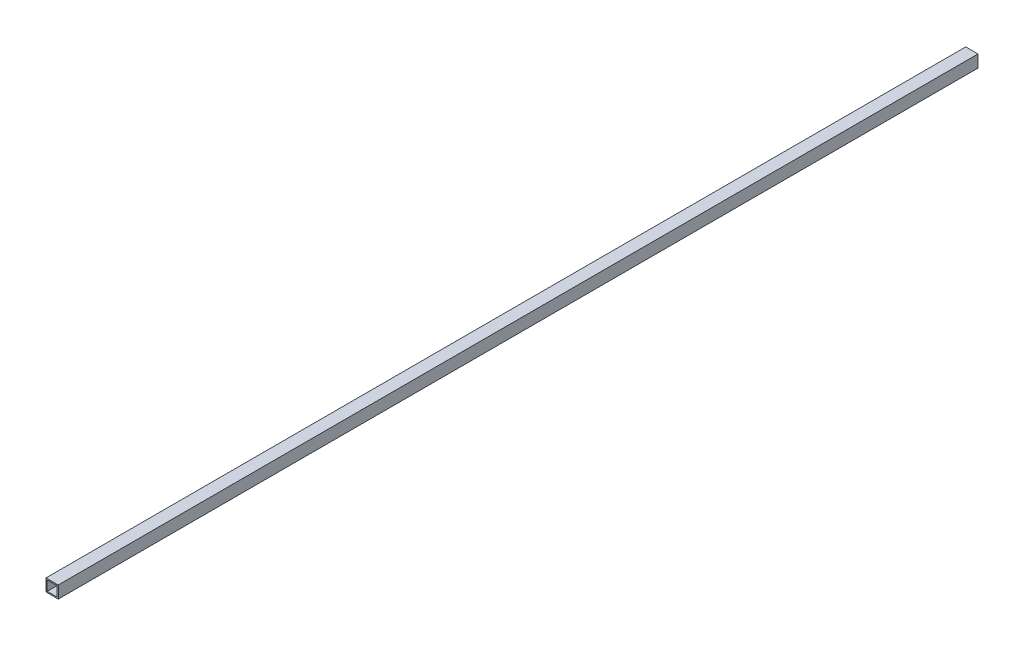
ISO-10303-21;
HEADER;
FILE_DESCRIPTION(('STEP AP214'),'2;1');
FILE_NAME('part.step','',(''),(''),'','','');
FILE_SCHEMA(('AUTOMOTIVE_DESIGN { 1 0 10303 214 1 1 1 1 }'));
ENDSEC;
DATA;
#1=APPLICATION_CONTEXT('core data for automotive mechanical design processes');
#2=APPLICATION_PROTOCOL_DEFINITION('international standard','automotive_design',2000,#1);
#3=PRODUCT_CONTEXT('',#1,'mechanical');
#4=PRODUCT('Part','Part','',(#3));
#5=PRODUCT_RELATED_PRODUCT_CATEGORY('part','',(#4));
#6=PRODUCT_DEFINITION_FORMATION('','',#4);
#7=PRODUCT_DEFINITION_CONTEXT('part definition',#1,'design');
#8=PRODUCT_DEFINITION('design','',#6,#7);
#9=PRODUCT_DEFINITION_SHAPE('','',#8);
#10=(LENGTH_UNIT() NAMED_UNIT(*) SI_UNIT(.MILLI.,.METRE.));
#11=(NAMED_UNIT(*) PLANE_ANGLE_UNIT() SI_UNIT($,.RADIAN.));
#12=(NAMED_UNIT(*) SI_UNIT($,.STERADIAN.) SOLID_ANGLE_UNIT());
#13=UNCERTAINTY_MEASURE_WITH_UNIT(LENGTH_MEASURE(1.E-05),#10,'distance_accuracy_value','');
#14=(GEOMETRIC_REPRESENTATION_CONTEXT(3) GLOBAL_UNCERTAINTY_ASSIGNED_CONTEXT((#13)) GLOBAL_UNIT_ASSIGNED_CONTEXT((#10,
#11,#12)) REPRESENTATION_CONTEXT('',''));
#15=CARTESIAN_POINT('',(0.,0.,0.));
#16=DIRECTION('',(0.,0.,1.));
#17=DIRECTION('',(1.,0.,0.));
#18=AXIS2_PLACEMENT_3D('',#15,#16,#17);
#19=CARTESIAN_POINT('',(0.,0.,1500.));
#20=DIRECTION('',(0.,0.,-1.));
#21=DIRECTION('',(-1.,0.,0.));
#22=AXIS2_PLACEMENT_3D('',#19,#20,#21);
#23=PLANE('',#22);
#24=DIRECTION('',(0.,1.,0.));
#25=VECTOR('',#24,1.);
#26=CARTESIAN_POINT('',(10.,-10.,1500.));
#27=LINE('',#26,#25);
#28=CARTESIAN_POINT('',(10.,-10.,1500.));
#29=VERTEX_POINT('',#28);
#30=CARTESIAN_POINT('',(10.,10.,1500.));
#31=VERTEX_POINT('',#30);
#32=EDGE_CURVE('E153',#29,#31,#27,.T.);
#33=ORIENTED_EDGE('',*,*,#32,.T.);
#34=DIRECTION('',(-1.,0.,0.));
#35=VECTOR('',#34,1.);
#36=CARTESIAN_POINT('',(-10.,10.,1500.));
#37=LINE('',#36,#35);
#38=CARTESIAN_POINT('',(-10.,10.,1500.));
#39=VERTEX_POINT('',#38);
#40=EDGE_CURVE('E157',#31,#39,#37,.T.);
#41=ORIENTED_EDGE('',*,*,#40,.T.);
#42=DIRECTION('',(0.,-1.,0.));
#43=VECTOR('',#42,1.);
#44=CARTESIAN_POINT('',(-10.,-10.,1500.));
#45=LINE('',#44,#43);
#46=CARTESIAN_POINT('',(-10.,-10.,1500.));
#47=VERTEX_POINT('',#46);
#48=EDGE_CURVE('E161',#39,#47,#45,.T.);
#49=ORIENTED_EDGE('',*,*,#48,.T.);
#50=DIRECTION('',(1.,0.,0.));
#51=VECTOR('',#50,1.);
#52=CARTESIAN_POINT('',(-10.,-10.,1500.));
#53=LINE('',#52,#51);
#54=EDGE_CURVE('E164',#47,#29,#53,.T.);
#55=ORIENTED_EDGE('',*,*,#54,.T.);
#56=EDGE_LOOP('',(#33,#41,#49,#55));
#57=FACE_BOUND('',#56,.T.);
#58=DIRECTION('',(0.,-1.,0.));
#59=VECTOR('',#58,1.);
#60=CARTESIAN_POINT('',(-8.,-8.,1500.));
#61=LINE('',#60,#59);
#62=CARTESIAN_POINT('',(-8.,8.,1500.));
#63=VERTEX_POINT('',#62);
#64=CARTESIAN_POINT('',(-8.,-8.,1500.));
#65=VERTEX_POINT('',#64);
#66=EDGE_CURVE('E105',#63,#65,#61,.T.);
#67=ORIENTED_EDGE('',*,*,#66,.F.);
#68=DIRECTION('',(-1.,0.,0.));
#69=VECTOR('',#68,1.);
#70=CARTESIAN_POINT('',(-8.,8.,1500.));
#71=LINE('',#70,#69);
#72=CARTESIAN_POINT('',(8.,8.,1500.));
#73=VERTEX_POINT('',#72);
#74=EDGE_CURVE('E131',#73,#63,#71,.T.);
#75=ORIENTED_EDGE('',*,*,#74,.F.);
#76=DIRECTION('',(0.,1.,0.));
#77=VECTOR('',#76,1.);
#78=CARTESIAN_POINT('',(8.,-8.,1500.));
#79=LINE('',#78,#77);
#80=CARTESIAN_POINT('',(8.,-8.,1500.));
#81=VERTEX_POINT('',#80);
#82=EDGE_CURVE('E127',#81,#73,#79,.T.);
#83=ORIENTED_EDGE('',*,*,#82,.F.);
#84=DIRECTION('',(1.,0.,0.));
#85=VECTOR('',#84,1.);
#86=CARTESIAN_POINT('',(-8.,-8.,1500.));
#87=LINE('',#86,#85);
#88=EDGE_CURVE('E114',#65,#81,#87,.T.);
#89=ORIENTED_EDGE('',*,*,#88,.F.);
#90=EDGE_LOOP('',(#67,#75,#83,#89));
#91=FACE_BOUND('',#90,.T.);
#92=ADVANCED_FACE('F39',(#57,#91),#23,.F.);
#93=CARTESIAN_POINT('',(0.,0.,0.));
#94=DIRECTION('',(0.,0.,-1.));
#95=DIRECTION('',(-1.,0.,0.));
#96=AXIS2_PLACEMENT_3D('',#93,#94,#95);
#97=PLANE('',#96);
#98=DIRECTION('',(0.,1.,0.));
#99=VECTOR('',#98,1.);
#100=CARTESIAN_POINT('',(10.,-10.,0.));
#101=LINE('',#100,#99);
#102=CARTESIAN_POINT('',(10.,-10.,0.));
#103=VERTEX_POINT('',#102);
#104=CARTESIAN_POINT('',(10.,10.,0.));
#105=VERTEX_POINT('',#104);
#106=EDGE_CURVE('E123',#103,#105,#101,.T.);
#107=ORIENTED_EDGE('',*,*,#106,.F.);
#108=DIRECTION('',(1.,0.,0.));
#109=VECTOR('',#108,1.);
#110=CARTESIAN_POINT('',(-10.,-10.,0.));
#111=LINE('',#110,#109);
#112=CARTESIAN_POINT('',(-10.,-10.,0.));
#113=VERTEX_POINT('',#112);
#114=EDGE_CURVE('E158',#113,#103,#111,.T.);
#115=ORIENTED_EDGE('',*,*,#114,.F.);
#116=DIRECTION('',(0.,-1.,0.));
#117=VECTOR('',#116,1.);
#118=CARTESIAN_POINT('',(-10.,-10.,0.));
#119=LINE('',#118,#117);
#120=CARTESIAN_POINT('',(-10.,10.,0.));
#121=VERTEX_POINT('',#120);
#122=EDGE_CURVE('E174',#121,#113,#119,.T.);
#123=ORIENTED_EDGE('',*,*,#122,.F.);
#124=DIRECTION('',(-1.,0.,0.));
#125=VECTOR('',#124,1.);
#126=CARTESIAN_POINT('',(-10.,10.,0.));
#127=LINE('',#126,#125);
#128=EDGE_CURVE('E171',#105,#121,#127,.T.);
#129=ORIENTED_EDGE('',*,*,#128,.F.);
#130=EDGE_LOOP('',(#107,#115,#123,#129));
#131=FACE_BOUND('',#130,.T.);
#132=DIRECTION('',(-1.,0.,0.));
#133=VECTOR('',#132,1.);
#134=CARTESIAN_POINT('',(-8.,8.,0.));
#135=LINE('',#134,#133);
#136=CARTESIAN_POINT('',(8.,8.,0.));
#137=VERTEX_POINT('',#136);
#138=CARTESIAN_POINT('',(-8.,8.,0.));
#139=VERTEX_POINT('',#138);
#140=EDGE_CURVE('E115',#137,#139,#135,.T.);
#141=ORIENTED_EDGE('',*,*,#140,.T.);
#142=DIRECTION('',(0.,-1.,0.));
#143=VECTOR('',#142,1.);
#144=CARTESIAN_POINT('',(-8.,-8.,0.));
#145=LINE('',#144,#143);
#146=CARTESIAN_POINT('',(-8.,-8.,0.));
#147=VERTEX_POINT('',#146);
#148=EDGE_CURVE('E63',#139,#147,#145,.T.);
#149=ORIENTED_EDGE('',*,*,#148,.T.);
#150=DIRECTION('',(1.,0.,0.));
#151=VECTOR('',#150,1.);
#152=CARTESIAN_POINT('',(-8.,-8.,0.));
#153=LINE('',#152,#151);
#154=CARTESIAN_POINT('',(8.,-8.,0.));
#155=VERTEX_POINT('',#154);
#156=EDGE_CURVE('E121',#147,#155,#153,.T.);
#157=ORIENTED_EDGE('',*,*,#156,.T.);
#158=DIRECTION('',(0.,1.,0.));
#159=VECTOR('',#158,1.);
#160=CARTESIAN_POINT('',(8.,-8.,0.));
#161=LINE('',#160,#159);
#162=EDGE_CURVE('E140',#155,#137,#161,.T.);
#163=ORIENTED_EDGE('',*,*,#162,.T.);
#164=EDGE_LOOP('',(#141,#149,#157,#163));
#165=FACE_BOUND('',#164,.T.);
#166=ADVANCED_FACE('F197',(#131,#165),#97,.T.);
#167=CARTESIAN_POINT('',(10.,-10.,1500.));
#168=DIRECTION('',(-1.,0.,0.));
#169=DIRECTION('',(0.,0.,1.));
#170=AXIS2_PLACEMENT_3D('',#167,#168,#169);
#171=PLANE('',#170);
#172=ORIENTED_EDGE('',*,*,#106,.T.);
#173=DIRECTION('',(0.,0.,-1.));
#174=VECTOR('',#173,1.);
#175=CARTESIAN_POINT('',(10.,10.,1500.));
#176=LINE('',#175,#174);
#177=EDGE_CURVE('E11',#31,#105,#176,.T.);
#178=ORIENTED_EDGE('',*,*,#177,.F.);
#179=ORIENTED_EDGE('',*,*,#32,.F.);
#180=DIRECTION('',(0.,0.,-1.));
#181=VECTOR('',#180,1.);
#182=CARTESIAN_POINT('',(10.,-10.,1500.));
#183=LINE('',#182,#181);
#184=EDGE_CURVE('E167',#29,#103,#183,.T.);
#185=ORIENTED_EDGE('',*,*,#184,.T.);
#186=EDGE_LOOP('',(#172,#178,#179,#185));
#187=FACE_BOUND('',#186,.T.);
#188=ADVANCED_FACE('F41',(#187),#171,.F.);
#189=CARTESIAN_POINT('',(-10.,10.,1500.));
#190=DIRECTION('',(0.,-1.,0.));
#191=DIRECTION('',(0.,0.,-1.));
#192=AXIS2_PLACEMENT_3D('',#189,#190,#191);
#193=PLANE('',#192);
#194=ORIENTED_EDGE('',*,*,#128,.T.);
#195=DIRECTION('',(0.,0.,-1.));
#196=VECTOR('',#195,1.);
#197=CARTESIAN_POINT('',(-10.,10.,1500.));
#198=LINE('',#197,#196);
#199=EDGE_CURVE('E48',#39,#121,#198,.T.);
#200=ORIENTED_EDGE('',*,*,#199,.F.);
#201=ORIENTED_EDGE('',*,*,#40,.F.);
#202=ORIENTED_EDGE('',*,*,#177,.T.);
#203=EDGE_LOOP('',(#194,#200,#201,#202));
#204=FACE_BOUND('',#203,.T.);
#205=ADVANCED_FACE('F207',(#204),#193,.F.);
#206=CARTESIAN_POINT('',(-10.,-10.,1500.));
#207=DIRECTION('',(1.,0.,0.));
#208=DIRECTION('',(0.,0.,-1.));
#209=AXIS2_PLACEMENT_3D('',#206,#207,#208);
#210=PLANE('',#209);
#211=ORIENTED_EDGE('',*,*,#122,.T.);
#212=DIRECTION('',(0.,0.,-1.));
#213=VECTOR('',#212,1.);
#214=CARTESIAN_POINT('',(-10.,-10.,1500.));
#215=LINE('',#214,#213);
#216=EDGE_CURVE('E182',#47,#113,#215,.T.);
#217=ORIENTED_EDGE('',*,*,#216,.F.);
#218=ORIENTED_EDGE('',*,*,#48,.F.);
#219=ORIENTED_EDGE('',*,*,#199,.T.);
#220=EDGE_LOOP('',(#211,#217,#218,#219));
#221=FACE_BOUND('',#220,.T.);
#222=ADVANCED_FACE('F191',(#221),#210,.F.);
#223=CARTESIAN_POINT('',(-10.,-10.,1500.));
#224=DIRECTION('',(0.,1.,0.));
#225=DIRECTION('',(0.,0.,1.));
#226=AXIS2_PLACEMENT_3D('',#223,#224,#225);
#227=PLANE('',#226);
#228=ORIENTED_EDGE('',*,*,#114,.T.);
#229=ORIENTED_EDGE('',*,*,#184,.F.);
#230=ORIENTED_EDGE('',*,*,#54,.F.);
#231=ORIENTED_EDGE('',*,*,#216,.T.);
#232=EDGE_LOOP('',(#228,#229,#230,#231));
#233=FACE_BOUND('',#232,.T.);
#234=ADVANCED_FACE('F201',(#233),#227,.F.);
#235=CARTESIAN_POINT('',(-8.,-8.,1500.));
#236=DIRECTION('',(1.,0.,0.));
#237=DIRECTION('',(0.,0.,-1.));
#238=AXIS2_PLACEMENT_3D('',#235,#236,#237);
#239=PLANE('',#238);
#240=ORIENTED_EDGE('',*,*,#148,.F.);
#241=DIRECTION('',(0.,0.,-1.));
#242=VECTOR('',#241,1.);
#243=CARTESIAN_POINT('',(-8.,8.,1500.));
#244=LINE('',#243,#242);
#245=EDGE_CURVE('E109',#63,#139,#244,.T.);
#246=ORIENTED_EDGE('',*,*,#245,.F.);
#247=ORIENTED_EDGE('',*,*,#66,.T.);
#248=DIRECTION('',(0.,0.,-1.));
#249=VECTOR('',#248,1.);
#250=CARTESIAN_POINT('',(-8.,-8.,1500.));
#251=LINE('',#250,#249);
#252=EDGE_CURVE('E108',#65,#147,#251,.T.);
#253=ORIENTED_EDGE('',*,*,#252,.T.);
#254=EDGE_LOOP('',(#240,#246,#247,#253));
#255=FACE_BOUND('',#254,.T.);
#256=ADVANCED_FACE('F107',(#255),#239,.T.);
#257=CARTESIAN_POINT('',(-8.,-8.,1500.));
#258=DIRECTION('',(0.,1.,0.));
#259=DIRECTION('',(0.,0.,1.));
#260=AXIS2_PLACEMENT_3D('',#257,#258,#259);
#261=PLANE('',#260);
#262=ORIENTED_EDGE('',*,*,#156,.F.);
#263=ORIENTED_EDGE('',*,*,#252,.F.);
#264=ORIENTED_EDGE('',*,*,#88,.T.);
#265=DIRECTION('',(0.,0.,-1.));
#266=VECTOR('',#265,1.);
#267=CARTESIAN_POINT('',(8.,-8.,1500.));
#268=LINE('',#267,#266);
#269=EDGE_CURVE('E124',#81,#155,#268,.T.);
#270=ORIENTED_EDGE('',*,*,#269,.T.);
#271=EDGE_LOOP('',(#262,#263,#264,#270));
#272=FACE_BOUND('',#271,.T.);
#273=ADVANCED_FACE('F118',(#272),#261,.T.);
#274=CARTESIAN_POINT('',(8.,-8.,1500.));
#275=DIRECTION('',(-1.,0.,0.));
#276=DIRECTION('',(0.,0.,1.));
#277=AXIS2_PLACEMENT_3D('',#274,#275,#276);
#278=PLANE('',#277);
#279=ORIENTED_EDGE('',*,*,#162,.F.);
#280=ORIENTED_EDGE('',*,*,#269,.F.);
#281=ORIENTED_EDGE('',*,*,#82,.T.);
#282=DIRECTION('',(0.,0.,-1.));
#283=VECTOR('',#282,1.);
#284=CARTESIAN_POINT('',(8.,8.,1500.));
#285=LINE('',#284,#283);
#286=EDGE_CURVE('E55',#73,#137,#285,.T.);
#287=ORIENTED_EDGE('',*,*,#286,.T.);
#288=EDGE_LOOP('',(#279,#280,#281,#287));
#289=FACE_BOUND('',#288,.T.);
#290=ADVANCED_FACE('F230',(#289),#278,.T.);
#291=CARTESIAN_POINT('',(-8.,8.,1500.));
#292=DIRECTION('',(0.,-1.,0.));
#293=DIRECTION('',(0.,0.,-1.));
#294=AXIS2_PLACEMENT_3D('',#291,#292,#293);
#295=PLANE('',#294);
#296=ORIENTED_EDGE('',*,*,#140,.F.);
#297=ORIENTED_EDGE('',*,*,#286,.F.);
#298=ORIENTED_EDGE('',*,*,#74,.T.);
#299=ORIENTED_EDGE('',*,*,#245,.T.);
#300=EDGE_LOOP('',(#296,#297,#298,#299));
#301=FACE_BOUND('',#300,.T.);
#302=ADVANCED_FACE('F234',(#301),#295,.T.);
#303=CLOSED_SHELL('',(#92,#166,#188,#205,#222,#234,#256,#273,#290,#302));
#304=MANIFOLD_SOLID_BREP('B2',#303);
#305=ADVANCED_BREP_SHAPE_REPRESENTATION('',(#18,#304),#14);
#306=SHAPE_DEFINITION_REPRESENTATION(#9,#305);
ENDSEC;
END-ISO-10303-21;
